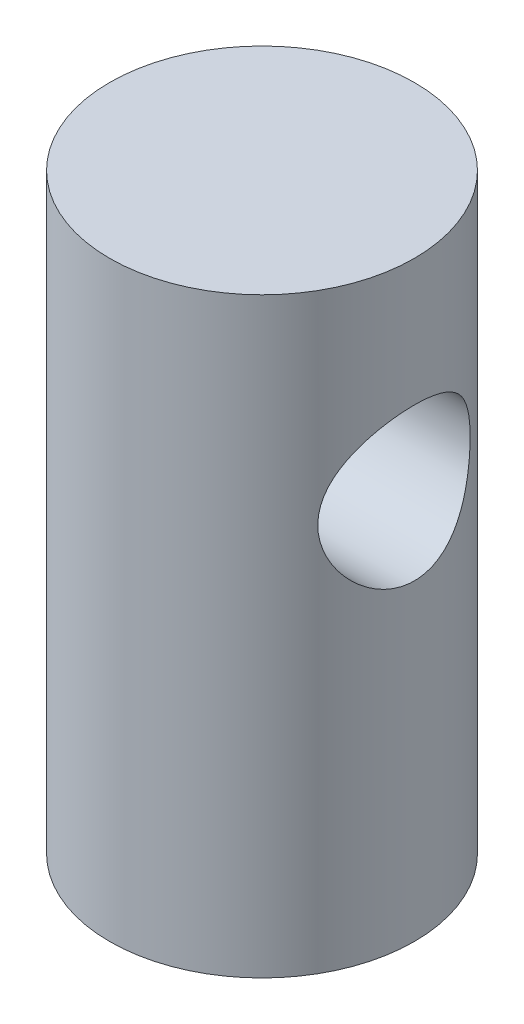
ISO-10303-21;
HEADER;
FILE_DESCRIPTION(('STEP AP214'),'2;1');
FILE_NAME('part.step','',(''),(''),'','','');
FILE_SCHEMA(('AUTOMOTIVE_DESIGN { 1 0 10303 214 1 1 1 1 }'));
ENDSEC;
DATA;
#1=APPLICATION_CONTEXT('core data for automotive mechanical design processes');
#2=APPLICATION_PROTOCOL_DEFINITION('international standard','automotive_design',2000,#1);
#3=PRODUCT_CONTEXT('',#1,'mechanical');
#4=PRODUCT('Part','Part','',(#3));
#5=PRODUCT_RELATED_PRODUCT_CATEGORY('part','',(#4));
#6=PRODUCT_DEFINITION_FORMATION('','',#4);
#7=PRODUCT_DEFINITION_CONTEXT('part definition',#1,'design');
#8=PRODUCT_DEFINITION('design','',#6,#7);
#9=PRODUCT_DEFINITION_SHAPE('','',#8);
#10=(LENGTH_UNIT() NAMED_UNIT(*) SI_UNIT(.MILLI.,.METRE.));
#11=(NAMED_UNIT(*) PLANE_ANGLE_UNIT() SI_UNIT($,.RADIAN.));
#12=(NAMED_UNIT(*) SI_UNIT($,.STERADIAN.) SOLID_ANGLE_UNIT());
#13=UNCERTAINTY_MEASURE_WITH_UNIT(LENGTH_MEASURE(1.E-05),#10,'distance_accuracy_value','');
#14=(GEOMETRIC_REPRESENTATION_CONTEXT(3) GLOBAL_UNCERTAINTY_ASSIGNED_CONTEXT((#13)) GLOBAL_UNIT_ASSIGNED_CONTEXT((#10,
#11,#12)) REPRESENTATION_CONTEXT('',''));
#15=CARTESIAN_POINT('',(0.,0.,0.));
#16=DIRECTION('',(0.,0.,1.));
#17=DIRECTION('',(1.,0.,0.));
#18=AXIS2_PLACEMENT_3D('',#15,#16,#17);
#19=CARTESIAN_POINT('',(0.,14.7955,0.));
#20=DIRECTION('',(0.,-1.,0.));
#21=DIRECTION('',(0.,0.,-1.));
#22=AXIS2_PLACEMENT_3D('',#19,#20,#21);
#23=CYLINDRICAL_SURFACE('',#22,3.81);
#24=CARTESIAN_POINT('',(-3.81,7.8105,0.));
#25=CARTESIAN_POINT('',(-3.80999454036603,7.81050629091425,-0.1001495894221));
#26=CARTESIAN_POINT('',(-3.80600885392636,7.81844398929561,-0.200418572423857));
#27=CARTESIAN_POINT('',(-3.79045767250784,7.84984373705063,-0.397993048187247));
#28=CARTESIAN_POINT('',(-3.77887778314092,7.87333526866084,-0.495292545189464));
#29=CARTESIAN_POINT('',(-3.7493501226343,7.93469420541468,-0.683768402997255));
#30=CARTESIAN_POINT('',(-3.73142711633209,7.97250574199238,-0.774966959599074));
#31=CARTESIAN_POINT('',(-3.69085704262526,8.06114203370029,-0.949590335016571));
#32=CARTESIAN_POINT('',(-3.66821034771866,8.11196576279409,-1.03301576605106));
#33=CARTESIAN_POINT('',(-3.61866671981608,8.22868036026947,-1.19540239283644));
#34=CARTESIAN_POINT('',(-3.59159554337958,8.29529674295151,-1.27378817718762));
#35=CARTESIAN_POINT('',(-3.53682243320045,8.4401434179656,-1.4188048424716));
#36=CARTESIAN_POINT('',(-3.50912003678211,8.5183824776265,-1.48542676581839));
#37=CARTESIAN_POINT('',(-3.45374502030947,8.69153078084204,-1.61020506085778));
#38=CARTESIAN_POINT('',(-3.42624131178101,8.78726226734896,-1.66730426422587));
#39=CARTESIAN_POINT('',(-3.37729789561271,8.98848977505374,-1.76435047222677));
#40=CARTESIAN_POINT('',(-3.35585385991315,9.09397875521684,-1.80430972951087));
#41=CARTESIAN_POINT('',(-3.32342236707025,9.30528702582876,-1.86334230236926));
#42=CARTESIAN_POINT('',(-3.31188577366974,9.41070848118838,-1.88352275773824));
#43=CARTESIAN_POINT('',(-3.29911500351945,9.6240196859699,-1.90581342225335));
#44=CARTESIAN_POINT('',(-3.29787064598964,9.73190689035955,-1.90794148835071));
#45=CARTESIAN_POINT('',(-3.30538322140058,9.93321487632077,-1.89487928206322));
#46=CARTESIAN_POINT('',(-3.31296194776136,10.0268227794799,-1.88172958591765));
#47=CARTESIAN_POINT('',(-3.33520215737985,10.2102702373556,-1.84202041245346));
#48=CARTESIAN_POINT('',(-3.34986589674534,10.3001085818066,-1.81545666352503));
#49=CARTESIAN_POINT('',(-3.38494642566272,10.4760314975376,-1.74918963163534));
#50=CARTESIAN_POINT('',(-3.40548926464917,10.5619798896869,-1.70919470285597));
#51=CARTESIAN_POINT('',(-3.45001985156074,10.726358327384,-1.61742441500755));
#52=CARTESIAN_POINT('',(-3.47400914506263,10.8047849733182,-1.56564376446275));
#53=CARTESIAN_POINT('',(-3.52640565805759,10.9623629864758,-1.44411583460886));
#54=CARTESIAN_POINT('',(-3.55498737001001,11.0403453441626,-1.37292294319348));
#55=CARTESIAN_POINT('',(-3.61088222387276,11.1837509724157,-1.21835337750232));
#56=CARTESIAN_POINT('',(-3.63819475481516,11.2491682408245,-1.13497091377401));
#57=CARTESIAN_POINT('',(-3.69002285774046,11.3684411842616,-0.953483943609671));
#58=CARTESIAN_POINT('',(-3.71434964828624,11.4216189000091,-0.854875591996873));
#59=CARTESIAN_POINT('',(-3.75585763535967,11.5101948403269,-0.648588140506157));
#60=CARTESIAN_POINT('',(-3.77304450387469,11.5456071824539,-0.54091632278535));
#61=CARTESIAN_POINT('',(-3.79712855777435,11.5947356440803,-0.329120166613638));
#62=CARTESIAN_POINT('',(-3.80476007463995,11.6100058040976,-0.225440615694562));
#63=CARTESIAN_POINT('',(-3.81139090639592,11.6232903128112,-0.0167251379035156));
#64=CARTESIAN_POINT('',(-3.81039431064112,11.6213128361432,0.0883101228521753));
#65=CARTESIAN_POINT('',(-3.80030721242793,11.6010562585623,0.288098811633304));
#66=CARTESIAN_POINT('',(-3.79185003035961,11.5840525251494,0.383018172335116));
#67=CARTESIAN_POINT('',(-3.76851236354771,11.5362264730398,0.568465129835197));
#68=CARTESIAN_POINT('',(-3.75363117067054,11.5054026309061,0.65899224124152));
#69=CARTESIAN_POINT('',(-3.71825998942885,11.4300029214451,0.836082799096436));
#70=CARTESIAN_POINT('',(-3.69762179771147,11.3850590495285,0.922458906296055));
#71=CARTESIAN_POINT('',(-3.65272271074681,11.2831101445933,1.08672889403711));
#72=CARTESIAN_POINT('',(-3.62846027355017,11.2260999735958,1.16461913972441));
#73=CARTESIAN_POINT('',(-3.57584161645457,11.095176389745,1.31781744809595));
#74=CARTESIAN_POINT('',(-3.54731735626866,11.020152835612,1.39212080824525));
#75=CARTESIAN_POINT('',(-3.49114856014802,10.8586425868159,1.52753629173142));
#76=CARTESIAN_POINT('',(-3.4635046439709,10.7721480285947,1.58863928978112));
#77=CARTESIAN_POINT('',(-3.41092521153362,10.5848588388005,1.69870357708253));
#78=CARTESIAN_POINT('',(-3.38618568867161,10.48357453809,1.74693356949947));
#79=CARTESIAN_POINT('',(-3.34468607720327,10.2726933212697,1.82514778340561));
#80=CARTESIAN_POINT('',(-3.32791571312434,10.1631073220806,1.85515551472667));
#81=CARTESIAN_POINT('',(-3.30634659454153,9.94998602540463,1.89330651462439));
#82=CARTESIAN_POINT('',(-3.30055315500949,9.84687974720586,1.90327215815238));
#83=CARTESIAN_POINT('',(-3.29880000592254,9.64035333705158,1.90631283908666));
#84=CARTESIAN_POINT('',(-3.30283603388273,9.53693336055437,1.89939519781728));
#85=CARTESIAN_POINT('',(-3.31923127207301,9.3431039295788,1.87056926925525));
#86=CARTESIAN_POINT('',(-3.33076094989464,9.25239360437427,1.85015183882348));
#87=CARTESIAN_POINT('',(-3.35986785837478,9.07578553249658,1.7967490574175));
#88=CARTESIAN_POINT('',(-3.37744703420218,8.98988934411468,1.76375966365965));
#89=CARTESIAN_POINT('',(-3.4181135034444,8.81895965887064,1.68366899479757));
#90=CARTESIAN_POINT('',(-3.44149151164229,8.7343718470157,1.63576851753891));
#91=CARTESIAN_POINT('',(-3.49063306764409,8.5738820085747,1.52809760096923));
#92=CARTESIAN_POINT('',(-3.51639785280638,8.49798453335728,1.46832098621517));
#93=CARTESIAN_POINT('',(-3.57115725616165,8.34743952361434,1.33007733728992));
#94=CARTESIAN_POINT('',(-3.60016393199127,8.27406441002269,1.25022182580978));
#95=CARTESIAN_POINT('',(-3.65527118055168,8.14146901655581,1.07852490587424));
#96=CARTESIAN_POINT('',(-3.68137018282902,8.08225636630983,0.986677077896399));
#97=CARTESIAN_POINT('',(-3.72804708224254,7.97959472903351,0.79234969187151));
#98=CARTESIAN_POINT('',(-3.74858463820942,7.93626015760453,0.68979955469467));
#99=CARTESIAN_POINT('',(-3.7814505517457,7.86801544042213,0.477663702668053));
#100=CARTESIAN_POINT('',(-3.79380223006644,7.84305293183511,0.368098958217234));
#101=CARTESIAN_POINT('',(-3.80419854945175,7.82212543188166,0.214506708065154));
#102=CARTESIAN_POINT('',(-3.80636840973178,7.81777206914962,0.17175838033618));
#103=CARTESIAN_POINT('',(-3.80927032740834,7.81195796219567,0.0860140490886992));
#104=CARTESIAN_POINT('',(-3.8100023451194,7.81049729781425,0.043018038766827));
#105=CARTESIAN_POINT('',(-3.81,7.8105,0.));
#106=B_SPLINE_CURVE_WITH_KNOTS('',3,(#24,#25,#26,#27,#28,#29,#30,#31,#32,#33,#34,#35,#36,#37,
#38,#39,#40,#41,#42,#43,#44,#45,#46,#47,#48,#49,#50,#51,#52,#53,#54,#55,#56,#57,#58,#59,#60,#61,
#62,#63,#64,#65,#66,#67,#68,#69,#70,#71,#72,#73,#74,#75,#76,#77,#78,#79,#80,#81,#82,#83,#84,#85,
#86,#87,#88,#89,#90,#91,#92,#93,#94,#95,#96,#97,#98,#99,#100,#101,#102,#103,#104,#105),
.UNSPECIFIED.,.T.,.F.,(4,2,2,2,2,2,2,2,2,2,2,2,2,2,2,2,2,2,2,2,2,2,2,2,2,2,2,2,2,2,2,2,2,2,2,2,
2,2,2,2,4),(0.,0.300274210385657,0.601119225196021,0.900802406212828,1.20046196390789,
1.51825025035796,1.83627948273094,2.17897188850584,2.52141890746225,2.84336513127137,
3.16499285711784,3.44815882139755,3.73141501478417,4.02126907520968,4.31125353000722,
4.63800713241038,4.96491643410497,5.30700657318509,5.64882443217893,5.96233168347913,
6.27569035394362,6.56476156894162,6.85386465706924,7.15123390733147,7.44873003675586,
7.77544058277618,8.10237626312397,8.44514469518088,8.78746995256084,9.09693330793304,
9.40626249042212,9.6861235712407,9.96607472341809,10.2648345016645,10.5637500397862,
10.8989858745241,11.2344019034127,11.5721894602902,11.9090105092329,12.0379860865511,
12.1669652236358),.UNSPECIFIED.);
#107=CARTESIAN_POINT('',(-3.81,7.8105,0.));
#108=VERTEX_POINT('',#107);
#109=EDGE_CURVE('E10',#108,#108,#106,.T.);
#110=ORIENTED_EDGE('',*,*,#109,.T.);
#111=EDGE_LOOP('',(#110));
#112=FACE_BOUND('',#111,.T.);
#113=CARTESIAN_POINT('',(3.29955678841871,9.7155,-1.905));
#114=CARTESIAN_POINT('',(3.29956654394383,9.61623692178569,-1.90499198708214));
#115=CARTESIAN_POINT('',(3.30410470951591,9.51684452685156,-1.89718915338941));
#116=CARTESIAN_POINT('',(3.32160278339791,9.32111244368785,-1.866373006325));
#117=CARTESIAN_POINT('',(3.33458038748244,9.22477961690651,-1.84332773093618));
#118=CARTESIAN_POINT('',(3.36707513169226,9.03836474348429,-1.78327032472124));
#119=CARTESIAN_POINT('',(3.38655744838383,8.94825243094609,-1.74633243851905));
#120=CARTESIAN_POINT('',(3.42981274244804,8.77552685092146,-1.65976465650994));
#121=CARTESIAN_POINT('',(3.45358595191944,8.69291398945147,-1.61013407408157));
#122=CARTESIAN_POINT('',(3.50514036225372,8.53000760041545,-1.49478975349745));
#123=CARTESIAN_POINT('',(3.53309041410511,8.45046735011883,-1.4280871271849));
#124=CARTESIAN_POINT('',(3.58848627026471,8.3031170165065,-1.28254850517537));
#125=CARTESIAN_POINT('',(3.61593181698771,8.23531278429071,-1.20370649407611));
#126=CARTESIAN_POINT('',(3.66943913648482,8.10888557811796,-1.0296326178128));
#127=CARTESIAN_POINT('',(3.69528292740811,8.0511895725093,-0.933654194937514));
#128=CARTESIAN_POINT('',(3.74048190355419,7.9531066742853,-0.731819135803415));
#129=CARTESIAN_POINT('',(3.75984118201359,7.91270885798586,-0.625968785187167));
#130=CARTESIAN_POINT('',(3.7886727867368,7.85335362028905,-0.415375618147425));
#131=CARTESIAN_POINT('',(3.79875059821709,7.83307515231077,-0.311089910872769));
#132=CARTESIAN_POINT('',(3.81014447225848,7.810183543906,-0.100147047677826));
#133=CARTESIAN_POINT('',(3.8114658362441,7.80755971479954,0.00650863413015922));
#134=CARTESIAN_POINT('',(3.80548480551051,7.81954241391774,0.209230959029217));
#135=CARTESIAN_POINT('',(3.79892234674623,7.83267041956906,0.305411884432316));
#136=CARTESIAN_POINT('',(3.77902937219762,7.87313800763724,0.493992735503873));
#137=CARTESIAN_POINT('',(3.76569834996465,7.9004786534994,0.586392377683784));
#138=CARTESIAN_POINT('',(3.73325866162997,7.9687722884014,0.766399390940143));
#139=CARTESIAN_POINT('',(3.71407261113128,8.00990837659287,0.853922771796453));
#140=CARTESIAN_POINT('',(3.67165215604635,8.10437180786376,1.02103580688285));
#141=CARTESIAN_POINT('',(3.64841630280006,8.15770351559095,1.10062260603761));
#142=CARTESIAN_POINT('',(3.59748571330533,8.28083564467042,1.25763082401107));
#143=CARTESIAN_POINT('',(3.56957711276524,8.35171626896106,1.33413641293093));
#144=CARTESIAN_POINT('',(3.51385518817876,8.50504342599198,1.47466882541727));
#145=CARTESIAN_POINT('',(3.48604195346023,8.58749877418209,1.53868604804891));
#146=CARTESIAN_POINT('',(3.43174617356183,8.76804480656789,1.65640766249341));
#147=CARTESIAN_POINT('',(3.40546029582298,8.86679587391827,1.70919898503319));
#148=CARTESIAN_POINT('',(3.35995232780687,9.07339626393889,1.79702291026734));
#149=CARTESIAN_POINT('',(3.34072287237758,9.18123595489845,1.83207404389174));
#150=CARTESIAN_POINT('',(3.3136453123145,9.39396364399371,1.8805783020027));
#151=CARTESIAN_POINT('',(3.30501604391386,9.49840833177796,1.89552285763855));
#152=CARTESIAN_POINT('',(3.29789636383866,9.70864455558902,1.90788978329477));
#153=CARTESIAN_POINT('',(3.29939879024139,9.81443508747321,1.90532453068513));
#154=CARTESIAN_POINT('',(3.31154411109814,10.0120207148925,1.88411366257025));
#155=CARTESIAN_POINT('',(3.32116914200176,10.1040808543605,1.86725779083724));
#156=CARTESIAN_POINT('',(3.34697111055305,10.2838906328462,1.82060142222481));
#157=CARTESIAN_POINT('',(3.3631501698959,10.3716388656725,1.79079673327802));
#158=CARTESIAN_POINT('',(3.40111503061746,10.5449585853694,1.71763865629227));
#159=CARTESIAN_POINT('',(3.42312580378035,10.630241027105,1.6737216913345));
#160=CARTESIAN_POINT('',(3.47007407642261,10.7927189622828,1.57407685695025));
#161=CARTESIAN_POINT('',(3.49501307641559,10.8699102708966,1.5183429202534));
#162=CARTESIAN_POINT('',(3.54878637059317,11.0241945521281,1.38843480351322));
#163=CARTESIAN_POINT('',(3.57771540908909,11.1000485721004,1.31282174375767));
#164=CARTESIAN_POINT('',(3.63348717632896,11.2383803133945,1.14948556373608));
#165=CARTESIAN_POINT('',(3.66032919839729,11.3008535163518,1.06175836922721));
#166=CARTESIAN_POINT('',(3.70982294021229,11.4120429478707,0.873509865665426));
#167=CARTESIAN_POINT('',(3.73234537385049,11.4603525899488,0.77271200084465));
#168=CARTESIAN_POINT('',(3.76967791197634,11.5388477070911,0.562970104675266));
#169=CARTESIAN_POINT('',(3.78449478704111,11.5690490967591,0.454033321279063));
#170=CARTESIAN_POINT('',(3.80366603085923,11.6078671139296,0.241896294724124));
#171=CARTESIAN_POINT('',(3.80885562663092,11.6182099506027,0.139086800123055));
#172=CARTESIAN_POINT('',(3.81080258366636,11.6221064236309,-0.0669150028251235));
#173=CARTESIAN_POINT('',(3.80756289674906,11.6156659372737,-0.170107164529988));
#174=CARTESIAN_POINT('',(3.79350210629254,11.5873217348386,-0.366784876795359));
#175=CARTESIAN_POINT('',(3.78319464317244,11.5664649252131,-0.460461970607192));
#176=CARTESIAN_POINT('',(3.75650938454101,11.5112921032841,-0.642834533732316));
#177=CARTESIAN_POINT('',(3.74013071852114,11.4769741608392,-0.731529286560458));
#178=CARTESIAN_POINT('',(3.70190897977004,11.3943248221207,-0.905681609000896));
#179=CARTESIAN_POINT('',(3.67986215390147,11.3454568431864,-0.990838473351061));
#180=CARTESIAN_POINT('',(3.63260894008916,11.2357706880675,-1.15209561611304));
#181=CARTESIAN_POINT('',(3.60740110290715,11.1749470232183,-1.22819170900714));
#182=CARTESIAN_POINT('',(3.55337000945654,11.0360492046297,-1.37715149251169));
#183=CARTESIAN_POINT('',(3.52443661119087,10.9568606927877,-1.44893981749937));
#184=CARTESIAN_POINT('',(3.46830166093714,10.7871651525385,-1.57860233295291));
#185=CARTESIAN_POINT('',(3.44110165662072,10.6966482173791,-1.63646421361485));
#186=CARTESIAN_POINT('',(3.39089224909555,10.5029232783409,-1.73818595767762));
#187=CARTESIAN_POINT('',(3.3680424409578,10.3994046100247,-1.78154554518773));
#188=CARTESIAN_POINT('',(3.34038147771082,10.2388243410515,-1.83257122853323));
#189=CARTESIAN_POINT('',(3.33226780836254,10.1844654508874,-1.84723722005939));
#190=CARTESIAN_POINT('',(3.31856771505668,10.0743709889811,-1.87173936489303));
#191=CARTESIAN_POINT('',(3.31297952435838,10.0186364085016,-1.88157889504477));
#192=CARTESIAN_POINT('',(3.30573720044492,9.92162024824196,-1.89426468645562));
#193=CARTESIAN_POINT('',(3.30342611219554,9.8805367629693,-1.89828575114556));
#194=CARTESIAN_POINT('',(3.30033382393031,9.79814300232902,-1.90365516558915));
#195=CARTESIAN_POINT('',(3.29955272626069,9.75683271197497,-1.90500333654398));
#196=CARTESIAN_POINT('',(3.29955678841871,9.7155,-1.905));
#197=B_SPLINE_CURVE_WITH_KNOTS('',3,(#113,#114,#115,#116,#117,#118,#119,#120,#121,#122,#123,
#124,#125,#126,#127,#128,#129,#130,#131,#132,#133,#134,#135,#136,#137,#138,#139,#140,#141,#142,
#143,#144,#145,#146,#147,#148,#149,#150,#151,#152,#153,#154,#155,#156,#157,#158,#159,#160,#161,
#162,#163,#164,#165,#166,#167,#168,#169,#170,#171,#172,#173,#174,#175,#176,#177,#178,#179,#180,
#181,#182,#183,#184,#185,#186,#187,#188,#189,#190,#191,#192,#193,#194,#195,#196),.UNSPECIFIED.,
.T.,.F.,(4,2,2,2,2,2,2,2,2,2,2,2,2,2,2,2,2,2,2,2,2,2,2,2,2,2,2,2,2,2,2,2,2,2,2,2,2,2,2,2,2,4),
(0.,0.297622193542933,0.595870460831253,0.892546975248113,1.18923954201174,1.51040270534787,
1.831725529196,2.17470784718718,2.51747325370086,2.8358493886779,3.1540327512578,
3.44454665711919,3.73508230349625,4.02963763666708,4.32429855266141,4.6468129972925,
4.96957441912348,5.31283243498472,5.65573114877171,5.97145664081147,6.28695897527724,
6.56794819426642,6.84902844894573,7.1431269965747,7.43737691253064,7.76871846524941,
8.10017172787348,8.44037265595573,8.78027415539583,9.08898875095846,9.39759525346389,
9.68586629384067,9.97417868344258,10.2748223012447,10.5756042634574,10.9063201072825,
11.2373272112389,11.5787947692242,11.7492204045702,11.9195266305643,12.0434469221419,
12.1673755028827),.UNSPECIFIED.);
#198=CARTESIAN_POINT('',(3.29955678841871,9.7155,-1.905));
#199=VERTEX_POINT('',#198);
#200=EDGE_CURVE('E41',#199,#199,#197,.T.);
#201=ORIENTED_EDGE('',*,*,#200,.T.);
#202=EDGE_LOOP('',(#201));
#203=FACE_BOUND('',#202,.T.);
#204=CARTESIAN_POINT('',(0.,14.7955,0.));
#205=DIRECTION('',(0.,1.,0.));
#206=DIRECTION('',(0.,0.,1.));
#207=AXIS2_PLACEMENT_3D('',#204,#205,#206);
#208=CIRCLE('',#207,3.81);
#209=CARTESIAN_POINT('',(0.,14.7955,3.81));
#210=VERTEX_POINT('',#209);
#211=EDGE_CURVE('E45',#210,#210,#208,.T.);
#212=ORIENTED_EDGE('',*,*,#211,.F.);
#213=EDGE_LOOP('',(#212));
#214=FACE_BOUND('',#213,.T.);
#215=CARTESIAN_POINT('',(0.,0.,0.));
#216=DIRECTION('',(0.,1.,0.));
#217=DIRECTION('',(0.,0.,1.));
#218=AXIS2_PLACEMENT_3D('',#215,#216,#217);
#219=CIRCLE('',#218,3.81);
#220=CARTESIAN_POINT('',(0.,0.,3.81));
#221=VERTEX_POINT('',#220);
#222=EDGE_CURVE('E49',#221,#221,#219,.T.);
#223=ORIENTED_EDGE('',*,*,#222,.T.);
#224=EDGE_LOOP('',(#223));
#225=FACE_BOUND('',#224,.T.);
#226=ADVANCED_FACE('F31',(#112,#203,#214,#225),#23,.T.);
#227=CARTESIAN_POINT('',(0.,14.7955,0.));
#228=DIRECTION('',(0.,1.,0.));
#229=DIRECTION('',(0.,0.,1.));
#230=AXIS2_PLACEMENT_3D('',#227,#228,#229);
#231=PLANE('',#230);
#232=ORIENTED_EDGE('',*,*,#211,.T.);
#233=EDGE_LOOP('',(#232));
#234=FACE_BOUND('',#233,.T.);
#235=ADVANCED_FACE('F60',(#234),#231,.T.);
#236=CARTESIAN_POINT('',(0.,0.,0.));
#237=DIRECTION('',(0.,1.,0.));
#238=DIRECTION('',(0.,0.,1.));
#239=AXIS2_PLACEMENT_3D('',#236,#237,#238);
#240=PLANE('',#239);
#241=ORIENTED_EDGE('',*,*,#222,.F.);
#242=EDGE_LOOP('',(#241));
#243=FACE_BOUND('',#242,.T.);
#244=ADVANCED_FACE('F58',(#243),#240,.F.);
#245=CARTESIAN_POINT('',(-3.81,9.7155,0.));
#246=DIRECTION('',(1.,0.,0.));
#247=DIRECTION('',(0.,0.,-1.));
#248=AXIS2_PLACEMENT_3D('',#245,#246,#247);
#249=CYLINDRICAL_SURFACE('',#248,1.905);
#250=ORIENTED_EDGE('',*,*,#200,.F.);
#251=EDGE_LOOP('',(#250));
#252=FACE_BOUND('',#251,.T.);
#253=ORIENTED_EDGE('',*,*,#109,.F.);
#254=EDGE_LOOP('',(#253));
#255=FACE_BOUND('',#254,.T.);
#256=ADVANCED_FACE('F54',(#252,#255),#249,.F.);
#257=CLOSED_SHELL('',(#226,#235,#244,#256));
#258=MANIFOLD_SOLID_BREP('B2',#257);
#259=ADVANCED_BREP_SHAPE_REPRESENTATION('',(#18,#258),#14);
#260=SHAPE_DEFINITION_REPRESENTATION(#9,#259);
ENDSEC;
END-ISO-10303-21;
